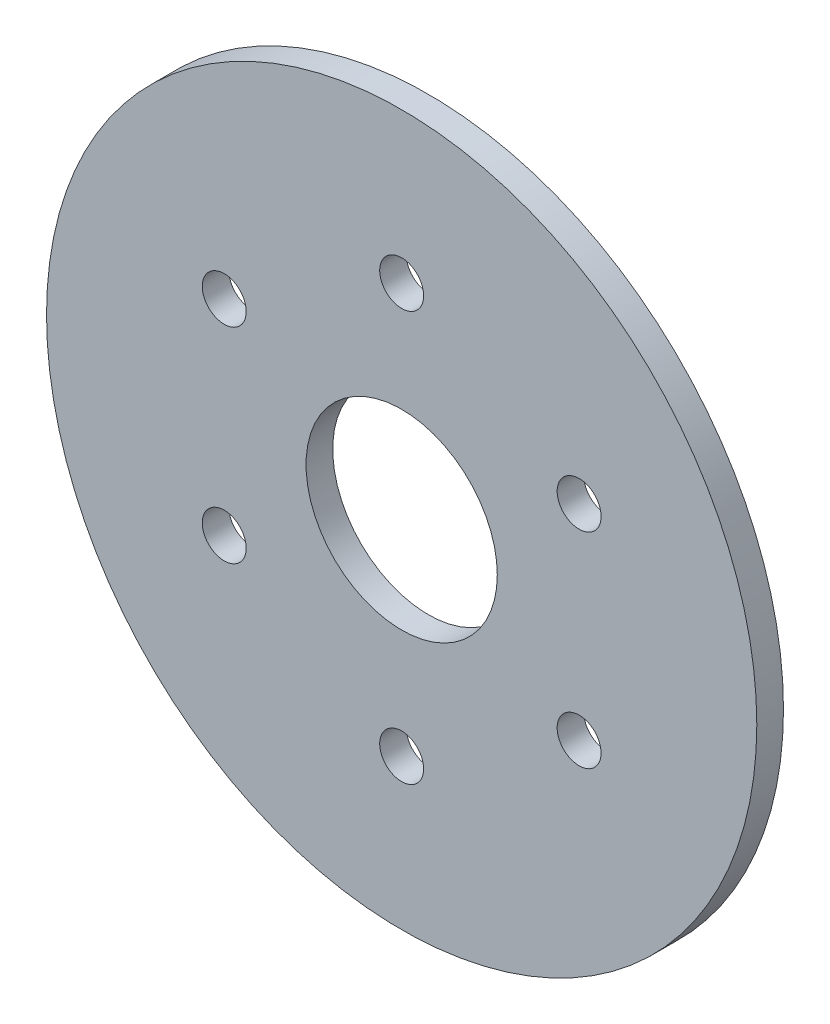
ISO-10303-21;
HEADER;
FILE_DESCRIPTION(('STEP AP214'),'2;1');
FILE_NAME('part.step','',(''),(''),'','','');
FILE_SCHEMA(('AUTOMOTIVE_DESIGN { 1 0 10303 214 1 1 1 1 }'));
ENDSEC;
DATA;
#1=APPLICATION_CONTEXT('core data for automotive mechanical design processes');
#2=APPLICATION_PROTOCOL_DEFINITION('international standard','automotive_design',2000,#1);
#3=PRODUCT_CONTEXT('',#1,'mechanical');
#4=PRODUCT('Part','Part','',(#3));
#5=PRODUCT_RELATED_PRODUCT_CATEGORY('part','',(#4));
#6=PRODUCT_DEFINITION_FORMATION('','',#4);
#7=PRODUCT_DEFINITION_CONTEXT('part definition',#1,'design');
#8=PRODUCT_DEFINITION('design','',#6,#7);
#9=PRODUCT_DEFINITION_SHAPE('','',#8);
#10=(LENGTH_UNIT() NAMED_UNIT(*) SI_UNIT(.MILLI.,.METRE.));
#11=(NAMED_UNIT(*) PLANE_ANGLE_UNIT() SI_UNIT($,.RADIAN.));
#12=(NAMED_UNIT(*) SI_UNIT($,.STERADIAN.) SOLID_ANGLE_UNIT());
#13=UNCERTAINTY_MEASURE_WITH_UNIT(LENGTH_MEASURE(1.E-05),#10,'distance_accuracy_value','');
#14=(GEOMETRIC_REPRESENTATION_CONTEXT(3) GLOBAL_UNCERTAINTY_ASSIGNED_CONTEXT((#13)) GLOBAL_UNIT_ASSIGNED_CONTEXT((#10,
#11,#12)) REPRESENTATION_CONTEXT('',''));
#15=CARTESIAN_POINT('',(0.,0.,0.));
#16=DIRECTION('',(0.,0.,1.));
#17=DIRECTION('',(1.,0.,0.));
#18=AXIS2_PLACEMENT_3D('',#15,#16,#17);
#19=CARTESIAN_POINT('',(0.,0.,3.0988));
#20=DIRECTION('',(0.,0.,-1.));
#21=DIRECTION('',(-1.,0.,0.));
#22=AXIS2_PLACEMENT_3D('',#19,#20,#21);
#23=PLANE('',#22);
#24=CARTESIAN_POINT('',(0.,23.8125,3.0988));
#25=DIRECTION('',(0.,0.,1.));
#26=DIRECTION('',(1.,0.,0.));
#27=AXIS2_PLACEMENT_3D('',#24,#25,#26);
#28=CIRCLE('',#27,2.5527);
#29=CARTESIAN_POINT('',(2.5527,23.8125,3.0988));
#30=VERTEX_POINT('',#29);
#31=EDGE_CURVE('E47',#30,#30,#28,.F.);
#32=ORIENTED_EDGE('',*,*,#31,.T.);
#33=EDGE_LOOP('',(#32));
#34=FACE_BOUND('',#33,.T.);
#35=CARTESIAN_POINT('',(-20.6222299276169,11.90625,3.0988));
#36=DIRECTION('',(0.,0.,1.));
#37=DIRECTION('',(1.,0.,0.));
#38=AXIS2_PLACEMENT_3D('',#35,#36,#37);
#39=CIRCLE('',#38,2.5527);
#40=CARTESIAN_POINT('',(-18.0695299276169,11.90625,3.0988));
#41=VERTEX_POINT('',#40);
#42=EDGE_CURVE('E50',#41,#41,#39,.F.);
#43=ORIENTED_EDGE('',*,*,#42,.T.);
#44=EDGE_LOOP('',(#43));
#45=FACE_BOUND('',#44,.T.);
#46=CARTESIAN_POINT('',(-20.6222299276169,-11.90625,3.0988));
#47=DIRECTION('',(0.,0.,1.));
#48=DIRECTION('',(1.,0.,0.));
#49=AXIS2_PLACEMENT_3D('',#46,#47,#48);
#50=CIRCLE('',#49,2.5527);
#51=CARTESIAN_POINT('',(-18.0695299276169,-11.90625,3.0988));
#52=VERTEX_POINT('',#51);
#53=EDGE_CURVE('E53',#52,#52,#50,.F.);
#54=ORIENTED_EDGE('',*,*,#53,.T.);
#55=EDGE_LOOP('',(#54));
#56=FACE_BOUND('',#55,.T.);
#57=CARTESIAN_POINT('',(0.,-23.8125,3.0988));
#58=DIRECTION('',(0.,0.,1.));
#59=DIRECTION('',(1.,0.,0.));
#60=AXIS2_PLACEMENT_3D('',#57,#58,#59);
#61=CIRCLE('',#60,2.5527);
#62=CARTESIAN_POINT('',(2.5527,-23.8125,3.0988));
#63=VERTEX_POINT('',#62);
#64=EDGE_CURVE('E56',#63,#63,#61,.F.);
#65=ORIENTED_EDGE('',*,*,#64,.T.);
#66=EDGE_LOOP('',(#65));
#67=FACE_BOUND('',#66,.T.);
#68=CARTESIAN_POINT('',(20.6222299276169,-11.90625,3.0988));
#69=DIRECTION('',(0.,0.,1.));
#70=DIRECTION('',(1.,0.,0.));
#71=AXIS2_PLACEMENT_3D('',#68,#69,#70);
#72=CIRCLE('',#71,2.5527);
#73=CARTESIAN_POINT('',(23.1749299276169,-11.90625,3.0988));
#74=VERTEX_POINT('',#73);
#75=EDGE_CURVE('E59',#74,#74,#72,.F.);
#76=ORIENTED_EDGE('',*,*,#75,.T.);
#77=EDGE_LOOP('',(#76));
#78=FACE_BOUND('',#77,.T.);
#79=CARTESIAN_POINT('',(20.622229927617,11.90625,3.0988));
#80=DIRECTION('',(0.,0.,1.));
#81=DIRECTION('',(1.,0.,0.));
#82=AXIS2_PLACEMENT_3D('',#79,#80,#81);
#83=CIRCLE('',#82,2.5527);
#84=CARTESIAN_POINT('',(23.174929927617,11.90625,3.0988));
#85=VERTEX_POINT('',#84);
#86=EDGE_CURVE('E62',#85,#85,#83,.F.);
#87=ORIENTED_EDGE('',*,*,#86,.T.);
#88=EDGE_LOOP('',(#87));
#89=FACE_BOUND('',#88,.T.);
#90=CARTESIAN_POINT('',(0.,0.,3.0988));
#91=DIRECTION('',(0.,0.,1.));
#92=DIRECTION('',(1.,0.,0.));
#93=AXIS2_PLACEMENT_3D('',#90,#91,#92);
#94=CIRCLE('',#93,11.1125);
#95=CARTESIAN_POINT('',(11.1125,0.,3.0988));
#96=VERTEX_POINT('',#95);
#97=EDGE_CURVE('E64',#96,#96,#94,.F.);
#98=ORIENTED_EDGE('',*,*,#97,.T.);
#99=EDGE_LOOP('',(#98));
#100=FACE_BOUND('',#99,.T.);
#101=CARTESIAN_POINT('',(0.,0.,3.0988));
#102=DIRECTION('',(0.,0.,1.));
#103=DIRECTION('',(1.,0.,0.));
#104=AXIS2_PLACEMENT_3D('',#101,#102,#103);
#105=CIRCLE('',#104,41.275);
#106=CARTESIAN_POINT('',(41.275,0.,3.0988));
#107=VERTEX_POINT('',#106);
#108=EDGE_CURVE('E18',#107,#107,#105,.F.);
#109=ORIENTED_EDGE('',*,*,#108,.F.);
#110=EDGE_LOOP('',(#109));
#111=FACE_BOUND('',#110,.T.);
#112=ADVANCED_FACE('F15',(#34,#45,#56,#67,#78,#89,#100,#111),#23,.F.);
#113=CARTESIAN_POINT('',(0.,0.,0.));
#114=DIRECTION('',(0.,0.,1.));
#115=DIRECTION('',(1.,0.,0.));
#116=AXIS2_PLACEMENT_3D('',#113,#114,#115);
#117=CYLINDRICAL_SURFACE('',#116,41.275);
#118=CARTESIAN_POINT('',(0.,0.,0.));
#119=DIRECTION('',(0.,0.,1.));
#120=DIRECTION('',(1.,0.,0.));
#121=AXIS2_PLACEMENT_3D('',#118,#119,#120);
#122=CIRCLE('',#121,41.275);
#123=CARTESIAN_POINT('',(41.275,0.,0.));
#124=VERTEX_POINT('',#123);
#125=EDGE_CURVE('E44',#124,#124,#122,.F.);
#126=ORIENTED_EDGE('',*,*,#125,.F.);
#127=EDGE_LOOP('',(#126));
#128=FACE_BOUND('',#127,.T.);
#129=ORIENTED_EDGE('',*,*,#108,.T.);
#130=EDGE_LOOP('',(#129));
#131=FACE_BOUND('',#130,.T.);
#132=ADVANCED_FACE('F71',(#128,#131),#117,.T.);
#133=CARTESIAN_POINT('',(0.,0.,0.));
#134=DIRECTION('',(0.,0.,1.));
#135=DIRECTION('',(1.,0.,0.));
#136=AXIS2_PLACEMENT_3D('',#133,#134,#135);
#137=CYLINDRICAL_SURFACE('',#136,11.1125);
#138=CARTESIAN_POINT('',(0.,0.,0.));
#139=DIRECTION('',(0.,0.,1.));
#140=DIRECTION('',(1.,0.,0.));
#141=AXIS2_PLACEMENT_3D('',#138,#139,#140);
#142=CIRCLE('',#141,11.1125);
#143=CARTESIAN_POINT('',(11.1125,0.,0.));
#144=VERTEX_POINT('',#143);
#145=EDGE_CURVE('E41',#144,#144,#142,.T.);
#146=ORIENTED_EDGE('',*,*,#145,.F.);
#147=EDGE_LOOP('',(#146));
#148=FACE_BOUND('',#147,.T.);
#149=ORIENTED_EDGE('',*,*,#97,.F.);
#150=EDGE_LOOP('',(#149));
#151=FACE_BOUND('',#150,.T.);
#152=ADVANCED_FACE('F79',(#148,#151),#137,.F.);
#153=CARTESIAN_POINT('',(20.622229927617,11.90625,0.));
#154=DIRECTION('',(0.,0.,1.));
#155=DIRECTION('',(1.,0.,0.));
#156=AXIS2_PLACEMENT_3D('',#153,#154,#155);
#157=CYLINDRICAL_SURFACE('',#156,2.5527);
#158=CARTESIAN_POINT('',(20.622229927617,11.90625,0.));
#159=DIRECTION('',(0.,0.,1.));
#160=DIRECTION('',(1.,0.,0.));
#161=AXIS2_PLACEMENT_3D('',#158,#159,#160);
#162=CIRCLE('',#161,2.5527);
#163=CARTESIAN_POINT('',(23.174929927617,11.90625,0.));
#164=VERTEX_POINT('',#163);
#165=EDGE_CURVE('E38',#164,#164,#162,.T.);
#166=ORIENTED_EDGE('',*,*,#165,.F.);
#167=EDGE_LOOP('',(#166));
#168=FACE_BOUND('',#167,.T.);
#169=ORIENTED_EDGE('',*,*,#86,.F.);
#170=EDGE_LOOP('',(#169));
#171=FACE_BOUND('',#170,.T.);
#172=ADVANCED_FACE('F108',(#168,#171),#157,.F.);
#173=CARTESIAN_POINT('',(20.6222299276169,-11.90625,0.));
#174=DIRECTION('',(0.,0.,1.));
#175=DIRECTION('',(1.,0.,0.));
#176=AXIS2_PLACEMENT_3D('',#173,#174,#175);
#177=CYLINDRICAL_SURFACE('',#176,2.5527);
#178=CARTESIAN_POINT('',(20.6222299276169,-11.90625,0.));
#179=DIRECTION('',(0.,0.,1.));
#180=DIRECTION('',(1.,0.,0.));
#181=AXIS2_PLACEMENT_3D('',#178,#179,#180);
#182=CIRCLE('',#181,2.5527);
#183=CARTESIAN_POINT('',(23.1749299276169,-11.90625,0.));
#184=VERTEX_POINT('',#183);
#185=EDGE_CURVE('E35',#184,#184,#182,.T.);
#186=ORIENTED_EDGE('',*,*,#185,.F.);
#187=EDGE_LOOP('',(#186));
#188=FACE_BOUND('',#187,.T.);
#189=ORIENTED_EDGE('',*,*,#75,.F.);
#190=EDGE_LOOP('',(#189));
#191=FACE_BOUND('',#190,.T.);
#192=ADVANCED_FACE('F104',(#188,#191),#177,.F.);
#193=CARTESIAN_POINT('',(0.,-23.8125,0.));
#194=DIRECTION('',(0.,0.,1.));
#195=DIRECTION('',(1.,0.,0.));
#196=AXIS2_PLACEMENT_3D('',#193,#194,#195);
#197=CYLINDRICAL_SURFACE('',#196,2.5527);
#198=CARTESIAN_POINT('',(0.,-23.8125,0.));
#199=DIRECTION('',(0.,0.,1.));
#200=DIRECTION('',(1.,0.,0.));
#201=AXIS2_PLACEMENT_3D('',#198,#199,#200);
#202=CIRCLE('',#201,2.5527);
#203=CARTESIAN_POINT('',(2.5527,-23.8125,0.));
#204=VERTEX_POINT('',#203);
#205=EDGE_CURVE('E32',#204,#204,#202,.T.);
#206=ORIENTED_EDGE('',*,*,#205,.F.);
#207=EDGE_LOOP('',(#206));
#208=FACE_BOUND('',#207,.T.);
#209=ORIENTED_EDGE('',*,*,#64,.F.);
#210=EDGE_LOOP('',(#209));
#211=FACE_BOUND('',#210,.T.);
#212=ADVANCED_FACE('F100',(#208,#211),#197,.F.);
#213=CARTESIAN_POINT('',(-20.6222299276169,-11.90625,0.));
#214=DIRECTION('',(0.,0.,1.));
#215=DIRECTION('',(1.,0.,0.));
#216=AXIS2_PLACEMENT_3D('',#213,#214,#215);
#217=CYLINDRICAL_SURFACE('',#216,2.5527);
#218=CARTESIAN_POINT('',(-20.6222299276169,-11.90625,0.));
#219=DIRECTION('',(0.,0.,1.));
#220=DIRECTION('',(1.,0.,0.));
#221=AXIS2_PLACEMENT_3D('',#218,#219,#220);
#222=CIRCLE('',#221,2.5527);
#223=CARTESIAN_POINT('',(-18.0695299276169,-11.90625,0.));
#224=VERTEX_POINT('',#223);
#225=EDGE_CURVE('E27',#224,#224,#222,.T.);
#226=ORIENTED_EDGE('',*,*,#225,.F.);
#227=EDGE_LOOP('',(#226));
#228=FACE_BOUND('',#227,.T.);
#229=ORIENTED_EDGE('',*,*,#53,.F.);
#230=EDGE_LOOP('',(#229));
#231=FACE_BOUND('',#230,.T.);
#232=ADVANCED_FACE('F96',(#228,#231),#217,.F.);
#233=CARTESIAN_POINT('',(-20.6222299276169,11.90625,0.));
#234=DIRECTION('',(0.,0.,1.));
#235=DIRECTION('',(1.,0.,0.));
#236=AXIS2_PLACEMENT_3D('',#233,#234,#235);
#237=CYLINDRICAL_SURFACE('',#236,2.5527);
#238=CARTESIAN_POINT('',(-20.6222299276169,11.90625,0.));
#239=DIRECTION('',(0.,0.,1.));
#240=DIRECTION('',(1.,0.,0.));
#241=AXIS2_PLACEMENT_3D('',#238,#239,#240);
#242=CIRCLE('',#241,2.5527);
#243=CARTESIAN_POINT('',(-18.0695299276169,11.90625,0.));
#244=VERTEX_POINT('',#243);
#245=EDGE_CURVE('E22',#244,#244,#242,.T.);
#246=ORIENTED_EDGE('',*,*,#245,.F.);
#247=EDGE_LOOP('',(#246));
#248=FACE_BOUND('',#247,.T.);
#249=ORIENTED_EDGE('',*,*,#42,.F.);
#250=EDGE_LOOP('',(#249));
#251=FACE_BOUND('',#250,.T.);
#252=ADVANCED_FACE('F89',(#248,#251),#237,.F.);
#253=CARTESIAN_POINT('',(0.,23.8125,0.));
#254=DIRECTION('',(0.,0.,1.));
#255=DIRECTION('',(1.,0.,0.));
#256=AXIS2_PLACEMENT_3D('',#253,#254,#255);
#257=CYLINDRICAL_SURFACE('',#256,2.5527);
#258=CARTESIAN_POINT('',(0.,23.8125,0.));
#259=DIRECTION('',(0.,0.,1.));
#260=DIRECTION('',(1.,0.,0.));
#261=AXIS2_PLACEMENT_3D('',#258,#259,#260);
#262=CIRCLE('',#261,2.5527);
#263=CARTESIAN_POINT('',(2.5527,23.8125,0.));
#264=VERTEX_POINT('',#263);
#265=EDGE_CURVE('E10',#264,#264,#262,.T.);
#266=ORIENTED_EDGE('',*,*,#265,.F.);
#267=EDGE_LOOP('',(#266));
#268=FACE_BOUND('',#267,.T.);
#269=ORIENTED_EDGE('',*,*,#31,.F.);
#270=EDGE_LOOP('',(#269));
#271=FACE_BOUND('',#270,.T.);
#272=ADVANCED_FACE('F84',(#268,#271),#257,.F.);
#273=CARTESIAN_POINT('',(0.,0.,0.));
#274=DIRECTION('',(0.,0.,-1.));
#275=DIRECTION('',(-1.,0.,0.));
#276=AXIS2_PLACEMENT_3D('',#273,#274,#275);
#277=PLANE('',#276);
#278=ORIENTED_EDGE('',*,*,#265,.T.);
#279=EDGE_LOOP('',(#278));
#280=FACE_BOUND('',#279,.T.);
#281=ORIENTED_EDGE('',*,*,#245,.T.);
#282=EDGE_LOOP('',(#281));
#283=FACE_BOUND('',#282,.T.);
#284=ORIENTED_EDGE('',*,*,#225,.T.);
#285=EDGE_LOOP('',(#284));
#286=FACE_BOUND('',#285,.T.);
#287=ORIENTED_EDGE('',*,*,#205,.T.);
#288=EDGE_LOOP('',(#287));
#289=FACE_BOUND('',#288,.T.);
#290=ORIENTED_EDGE('',*,*,#185,.T.);
#291=EDGE_LOOP('',(#290));
#292=FACE_BOUND('',#291,.T.);
#293=ORIENTED_EDGE('',*,*,#165,.T.);
#294=EDGE_LOOP('',(#293));
#295=FACE_BOUND('',#294,.T.);
#296=ORIENTED_EDGE('',*,*,#145,.T.);
#297=EDGE_LOOP('',(#296));
#298=FACE_BOUND('',#297,.T.);
#299=ORIENTED_EDGE('',*,*,#125,.T.);
#300=EDGE_LOOP('',(#299));
#301=FACE_BOUND('',#300,.T.);
#302=ADVANCED_FACE('F82',(#280,#283,#286,#289,#292,#295,#298,#301),#277,.T.);
#303=CLOSED_SHELL('',(#112,#132,#152,#172,#192,#212,#232,#252,#272,#302));
#304=MANIFOLD_SOLID_BREP('B1',#303);
#305=ADVANCED_BREP_SHAPE_REPRESENTATION('',(#18,#304),#14);
#306=SHAPE_DEFINITION_REPRESENTATION(#9,#305);
ENDSEC;
END-ISO-10303-21;
